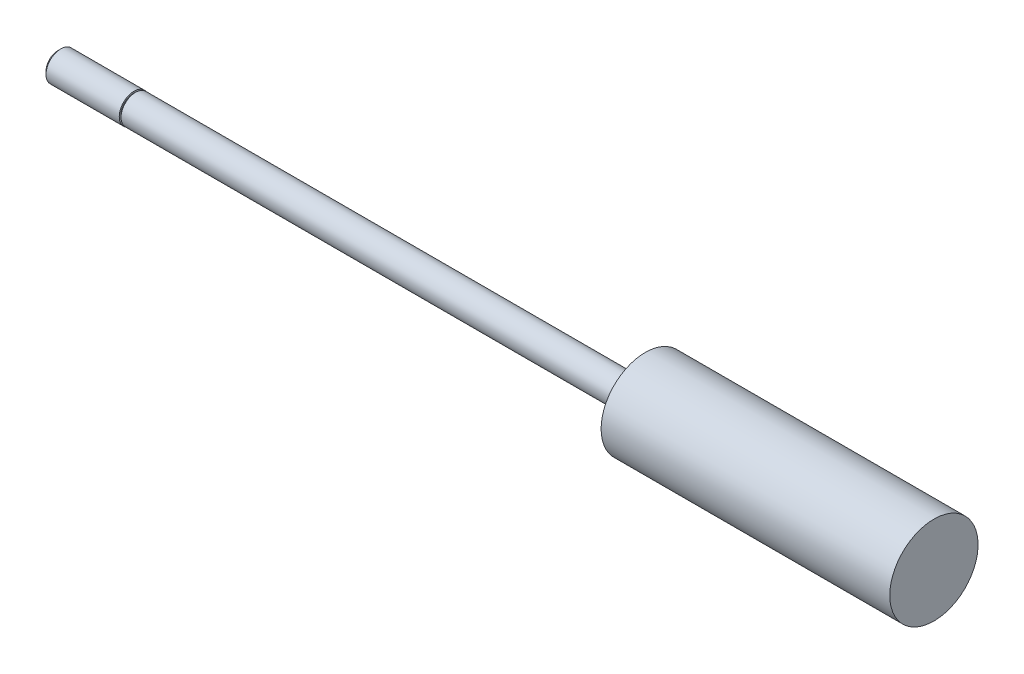
ISO-10303-21;
HEADER;
FILE_DESCRIPTION(('STEP AP214'),'2;1');
FILE_NAME('part.step','',(''),(''),'','','');
FILE_SCHEMA(('AUTOMOTIVE_DESIGN { 1 0 10303 214 1 1 1 1 }'));
ENDSEC;
DATA;
#1=APPLICATION_CONTEXT('core data for automotive mechanical design processes');
#2=APPLICATION_PROTOCOL_DEFINITION('international standard','automotive_design',2000,#1);
#3=PRODUCT_CONTEXT('',#1,'mechanical');
#4=PRODUCT('Part','Part','',(#3));
#5=PRODUCT_RELATED_PRODUCT_CATEGORY('part','',(#4));
#6=PRODUCT_DEFINITION_FORMATION('','',#4);
#7=PRODUCT_DEFINITION_CONTEXT('part definition',#1,'design');
#8=PRODUCT_DEFINITION('design','',#6,#7);
#9=PRODUCT_DEFINITION_SHAPE('','',#8);
#10=(LENGTH_UNIT() NAMED_UNIT(*) SI_UNIT(.MILLI.,.METRE.));
#11=(NAMED_UNIT(*) PLANE_ANGLE_UNIT() SI_UNIT($,.RADIAN.));
#12=(NAMED_UNIT(*) SI_UNIT($,.STERADIAN.) SOLID_ANGLE_UNIT());
#13=UNCERTAINTY_MEASURE_WITH_UNIT(LENGTH_MEASURE(1.E-05),#10,'distance_accuracy_value','');
#14=(GEOMETRIC_REPRESENTATION_CONTEXT(3) GLOBAL_UNCERTAINTY_ASSIGNED_CONTEXT((#13)) GLOBAL_UNIT_ASSIGNED_CONTEXT((#10,
#11,#12)) REPRESENTATION_CONTEXT('',''));
#15=CARTESIAN_POINT('',(0.,0.,0.));
#16=DIRECTION('',(0.,0.,1.));
#17=DIRECTION('',(1.,0.,0.));
#18=AXIS2_PLACEMENT_3D('',#15,#16,#17);
#19=CARTESIAN_POINT('',(130.5306,0.,0.));
#20=DIRECTION('',(-1.,0.,0.));
#21=DIRECTION('',(0.,0.,1.));
#22=AXIS2_PLACEMENT_3D('',#19,#20,#21);
#23=CYLINDRICAL_SURFACE('',#22,2.3749);
#24=CARTESIAN_POINT('',(0.,0.,0.));
#25=DIRECTION('',(-1.,0.,0.));
#26=DIRECTION('',(0.,0.,1.));
#27=AXIS2_PLACEMENT_3D('',#24,#25,#26);
#28=CIRCLE('',#27,2.3749);
#29=CARTESIAN_POINT('',(0.,0.,2.3749));
#30=VERTEX_POINT('',#29);
#31=EDGE_CURVE('E56',#30,#30,#28,.T.);
#32=ORIENTED_EDGE('',*,*,#31,.F.);
#33=EDGE_LOOP('',(#32));
#34=FACE_BOUND('',#33,.T.);
#35=CARTESIAN_POINT('',(83.3374,0.,0.));
#36=DIRECTION('',(-1.,0.,0.));
#37=DIRECTION('',(0.,0.,1.));
#38=AXIS2_PLACEMENT_3D('',#35,#36,#37);
#39=CIRCLE('',#38,2.3749);
#40=CARTESIAN_POINT('',(83.3374,0.,2.3749));
#41=VERTEX_POINT('',#40);
#42=EDGE_CURVE('E10',#41,#41,#39,.T.);
#43=ORIENTED_EDGE('',*,*,#42,.T.);
#44=EDGE_LOOP('',(#43));
#45=FACE_BOUND('',#44,.T.);
#46=ADVANCED_FACE('F34',(#34,#45),#23,.T.);
#47=CARTESIAN_POINT('',(83.3374,2.3749,0.));
#48=DIRECTION('',(1.,0.,0.));
#49=DIRECTION('',(0.,0.,-1.));
#50=AXIS2_PLACEMENT_3D('',#47,#48,#49);
#51=PLANE('',#50);
#52=ORIENTED_EDGE('',*,*,#42,.F.);
#53=EDGE_LOOP('',(#52));
#54=FACE_BOUND('',#53,.T.);
#55=CARTESIAN_POINT('',(83.3374,0.,0.));
#56=DIRECTION('',(-1.,0.,0.));
#57=DIRECTION('',(0.,0.,1.));
#58=AXIS2_PLACEMENT_3D('',#55,#56,#57);
#59=CIRCLE('',#58,7.21995);
#60=CARTESIAN_POINT('',(83.3374,0.,7.21995));
#61=VERTEX_POINT('',#60);
#62=EDGE_CURVE('E41',#61,#61,#59,.T.);
#63=ORIENTED_EDGE('',*,*,#62,.T.);
#64=EDGE_LOOP('',(#63));
#65=FACE_BOUND('',#64,.T.);
#66=ADVANCED_FACE('F77',(#54,#65),#51,.F.);
#67=CARTESIAN_POINT('',(130.5306,0.,0.));
#68=DIRECTION('',(-1.,0.,0.));
#69=DIRECTION('',(0.,0.,1.));
#70=AXIS2_PLACEMENT_3D('',#67,#68,#69);
#71=CYLINDRICAL_SURFACE('',#70,7.21995);
#72=ORIENTED_EDGE('',*,*,#62,.F.);
#73=EDGE_LOOP('',(#72));
#74=FACE_BOUND('',#73,.T.);
#75=CARTESIAN_POINT('',(130.5306,0.,0.));
#76=DIRECTION('',(-1.,0.,0.));
#77=DIRECTION('',(0.,0.,1.));
#78=AXIS2_PLACEMENT_3D('',#75,#76,#77);
#79=CIRCLE('',#78,7.21995);
#80=CARTESIAN_POINT('',(130.5306,0.,7.21995));
#81=VERTEX_POINT('',#80);
#82=EDGE_CURVE('E45',#81,#81,#79,.T.);
#83=ORIENTED_EDGE('',*,*,#82,.T.);
#84=EDGE_LOOP('',(#83));
#85=FACE_BOUND('',#84,.T.);
#86=ADVANCED_FACE('F81',(#74,#85),#71,.T.);
#87=CARTESIAN_POINT('',(130.5306,7.21995,0.));
#88=DIRECTION('',(-1.,0.,0.));
#89=DIRECTION('',(0.,0.,1.));
#90=AXIS2_PLACEMENT_3D('',#87,#88,#89);
#91=PLANE('',#90);
#92=ORIENTED_EDGE('',*,*,#82,.F.);
#93=EDGE_LOOP('',(#92));
#94=FACE_BOUND('',#93,.T.);
#95=ADVANCED_FACE('F86',(#94),#91,.F.);
#96=CARTESIAN_POINT('',(-0.254,2.667,0.));
#97=DIRECTION('',(1.,0.,0.));
#98=DIRECTION('',(0.,0.,-1.));
#99=AXIS2_PLACEMENT_3D('',#96,#97,#98);
#100=PLANE('',#99);
#101=CARTESIAN_POINT('',(-0.254,0.,0.));
#102=DIRECTION('',(-1.,0.,0.));
#103=DIRECTION('',(0.,0.,1.));
#104=AXIS2_PLACEMENT_3D('',#101,#102,#103);
#105=CIRCLE('',#104,2.159);
#106=CARTESIAN_POINT('',(-0.254,0.,2.159));
#107=VERTEX_POINT('',#106);
#108=EDGE_CURVE('E59',#107,#107,#105,.T.);
#109=ORIENTED_EDGE('',*,*,#108,.T.);
#110=EDGE_LOOP('',(#109));
#111=FACE_BOUND('',#110,.T.);
#112=CARTESIAN_POINT('',(-0.254,0.,0.));
#113=DIRECTION('',(1.,0.,0.));
#114=DIRECTION('',(0.,0.,-1.));
#115=AXIS2_PLACEMENT_3D('',#112,#113,#114);
#116=CIRCLE('',#115,2.413);
#117=CARTESIAN_POINT('',(-0.254,0.,-2.413));
#118=VERTEX_POINT('',#117);
#119=EDGE_CURVE('E37',#118,#118,#116,.T.);
#120=ORIENTED_EDGE('',*,*,#119,.T.);
#121=EDGE_LOOP('',(#120));
#122=FACE_BOUND('',#121,.T.);
#123=ADVANCED_FACE('F72',(#111,#122),#100,.T.);
#124=CARTESIAN_POINT('',(0.,2.159,0.));
#125=DIRECTION('',(-1.,0.,0.));
#126=DIRECTION('',(0.,0.,1.));
#127=AXIS2_PLACEMENT_3D('',#124,#125,#126);
#128=PLANE('',#127);
#129=CARTESIAN_POINT('',(0.,0.,0.));
#130=DIRECTION('',(-1.,0.,0.));
#131=DIRECTION('',(0.,0.,1.));
#132=AXIS2_PLACEMENT_3D('',#129,#130,#131);
#133=CIRCLE('',#132,2.159);
#134=CARTESIAN_POINT('',(0.,0.,2.159));
#135=VERTEX_POINT('',#134);
#136=EDGE_CURVE('E62',#135,#135,#133,.T.);
#137=ORIENTED_EDGE('',*,*,#136,.F.);
#138=EDGE_LOOP('',(#137));
#139=FACE_BOUND('',#138,.T.);
#140=ORIENTED_EDGE('',*,*,#31,.T.);
#141=EDGE_LOOP('',(#140));
#142=FACE_BOUND('',#141,.T.);
#143=ADVANCED_FACE('F69',(#139,#142),#128,.T.);
#144=CARTESIAN_POINT('',(0.,0.,0.));
#145=DIRECTION('',(-1.,0.,0.));
#146=DIRECTION('',(0.,0.,1.));
#147=AXIS2_PLACEMENT_3D('',#144,#145,#146);
#148=CYLINDRICAL_SURFACE('',#147,2.159);
#149=ORIENTED_EDGE('',*,*,#136,.T.);
#150=EDGE_LOOP('',(#149));
#151=FACE_BOUND('',#150,.T.);
#152=ORIENTED_EDGE('',*,*,#108,.F.);
#153=EDGE_LOOP('',(#152));
#154=FACE_BOUND('',#153,.T.);
#155=ADVANCED_FACE('F66',(#151,#154),#148,.T.);
#156=CARTESIAN_POINT('',(-12.7,0.,0.));
#157=DIRECTION('',(1.,0.,0.));
#158=DIRECTION('',(0.,0.,-1.));
#159=AXIS2_PLACEMENT_3D('',#156,#157,#158);
#160=PLANE('',#159);
#161=CARTESIAN_POINT('',(-12.7,0.,0.));
#162=DIRECTION('',(-1.,0.,0.));
#163=DIRECTION('',(0.,0.,1.));
#164=AXIS2_PLACEMENT_3D('',#161,#162,#163);
#165=CIRCLE('',#164,1.94056);
#166=CARTESIAN_POINT('',(-12.7,0.,1.94056));
#167=VERTEX_POINT('',#166);
#168=EDGE_CURVE('E50',#167,#167,#165,.T.);
#169=ORIENTED_EDGE('',*,*,#168,.T.);
#170=EDGE_LOOP('',(#169));
#171=FACE_BOUND('',#170,.T.);
#172=ADVANCED_FACE('F94',(#171),#160,.F.);
#173=CARTESIAN_POINT('',(-12.22756,0.,0.));
#174=DIRECTION('',(1.,0.,0.));
#175=DIRECTION('',(0.,0.,-1.));
#176=AXIS2_PLACEMENT_3D('',#173,#174,#175);
#177=CONICAL_SURFACE('',#176,2.413,0.785398163397449);
#178=ORIENTED_EDGE('',*,*,#168,.F.);
#179=EDGE_LOOP('',(#178));
#180=FACE_BOUND('',#179,.T.);
#181=CARTESIAN_POINT('',(-12.22756,0.,0.));
#182=DIRECTION('',(-1.,0.,0.));
#183=DIRECTION('',(0.,0.,1.));
#184=AXIS2_PLACEMENT_3D('',#181,#182,#183);
#185=CIRCLE('',#184,2.413);
#186=CARTESIAN_POINT('',(-12.22756,0.,2.413));
#187=VERTEX_POINT('',#186);
#188=EDGE_CURVE('E53',#187,#187,#185,.T.);
#189=ORIENTED_EDGE('',*,*,#188,.T.);
#190=EDGE_LOOP('',(#189));
#191=FACE_BOUND('',#190,.T.);
#192=ADVANCED_FACE('F97',(#180,#191),#177,.T.);
#193=CARTESIAN_POINT('',(0.,0.,0.));
#194=DIRECTION('',(-1.,0.,0.));
#195=DIRECTION('',(0.,0.,1.));
#196=AXIS2_PLACEMENT_3D('',#193,#194,#195);
#197=CYLINDRICAL_SURFACE('',#196,2.413);
#198=ORIENTED_EDGE('',*,*,#188,.F.);
#199=EDGE_LOOP('',(#198));
#200=FACE_BOUND('',#199,.T.);
#201=ORIENTED_EDGE('',*,*,#119,.F.);
#202=EDGE_LOOP('',(#201));
#203=FACE_BOUND('',#202,.T.);
#204=ADVANCED_FACE('F101',(#200,#203),#197,.T.);
#205=CLOSED_SHELL('',(#46,#66,#86,#95,#123,#143,#155,#172,#192,#204));
#206=MANIFOLD_SOLID_BREP('B2',#205);
#207=ADVANCED_BREP_SHAPE_REPRESENTATION('',(#18,#206),#14);
#208=SHAPE_DEFINITION_REPRESENTATION(#9,#207);
ENDSEC;
END-ISO-10303-21;
